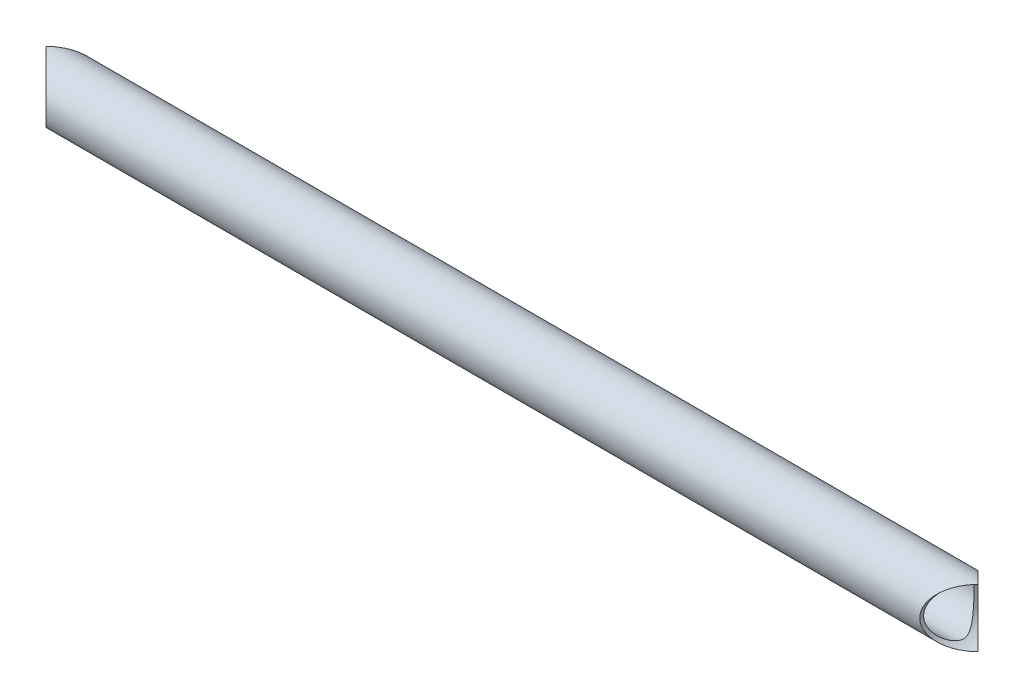
ISO-10303-21;
HEADER;
FILE_DESCRIPTION(('STEP AP214'),'2;1');
FILE_NAME('part.step','',(''),(''),'','','');
FILE_SCHEMA(('AUTOMOTIVE_DESIGN { 1 0 10303 214 1 1 1 1 }'));
ENDSEC;
DATA;
#1=APPLICATION_CONTEXT('core data for automotive mechanical design processes');
#2=APPLICATION_PROTOCOL_DEFINITION('international standard','automotive_design',2000,#1);
#3=PRODUCT_CONTEXT('',#1,'mechanical');
#4=PRODUCT('Part','Part','',(#3));
#5=PRODUCT_RELATED_PRODUCT_CATEGORY('part','',(#4));
#6=PRODUCT_DEFINITION_FORMATION('','',#4);
#7=PRODUCT_DEFINITION_CONTEXT('part definition',#1,'design');
#8=PRODUCT_DEFINITION('design','',#6,#7);
#9=PRODUCT_DEFINITION_SHAPE('','',#8);
#10=(LENGTH_UNIT() NAMED_UNIT(*) SI_UNIT(.MILLI.,.METRE.));
#11=(NAMED_UNIT(*) PLANE_ANGLE_UNIT() SI_UNIT($,.RADIAN.));
#12=(NAMED_UNIT(*) SI_UNIT($,.STERADIAN.) SOLID_ANGLE_UNIT());
#13=UNCERTAINTY_MEASURE_WITH_UNIT(LENGTH_MEASURE(1.E-05),#10,'distance_accuracy_value','');
#14=(GEOMETRIC_REPRESENTATION_CONTEXT(3) GLOBAL_UNCERTAINTY_ASSIGNED_CONTEXT((#13)) GLOBAL_UNIT_ASSIGNED_CONTEXT((#10,
#11,#12)) REPRESENTATION_CONTEXT('',''));
#15=CARTESIAN_POINT('',(0.,0.,0.));
#16=DIRECTION('',(0.,0.,1.));
#17=DIRECTION('',(1.,0.,0.));
#18=AXIS2_PLACEMENT_3D('',#15,#16,#17);
#19=CARTESIAN_POINT('',(152.4,228.6,-238.125));
#20=DIRECTION('',(0.,0.,1.));
#21=DIRECTION('',(1.,0.,0.));
#22=AXIS2_PLACEMENT_3D('',#19,#20,#21);
#23=CYLINDRICAL_SURFACE('',#22,9.52499999999999);
#24=CARTESIAN_POINT('',(152.4,228.6,101.6));
#25=DIRECTION('',(-0.707106781186547,0.,0.707106781186547));
#26=DIRECTION('',(-0.707106781186547,0.,-0.707106781186547));
#27=AXIS2_PLACEMENT_3D('',#24,#25,#26);
#28=ELLIPSE('',#27,13.4703841816037,9.525);
#29=CARTESIAN_POINT('',(152.4,219.075,101.6));
#30=VERTEX_POINT('',#29);
#31=CARTESIAN_POINT('',(152.4,238.125,101.6));
#32=VERTEX_POINT('',#31);
#33=EDGE_CURVE('E47',#30,#32,#28,.F.);
#34=ORIENTED_EDGE('',*,*,#33,.T.);
#35=CARTESIAN_POINT('',(152.4,228.6,101.6));
#36=DIRECTION('',(-0.707106781186547,0.,-0.707106781186547));
#37=DIRECTION('',(-0.707106781186547,0.,0.707106781186547));
#38=AXIS2_PLACEMENT_3D('',#35,#36,#37);
#39=ELLIPSE('',#38,13.4703841816037,9.525);
#40=EDGE_CURVE('E57',#32,#30,#39,.F.);
#41=ORIENTED_EDGE('',*,*,#40,.T.);
#42=EDGE_LOOP('',(#34,#41));
#43=FACE_BOUND('',#42,.T.);
#44=CARTESIAN_POINT('',(142.875,228.6,93.345));
#45=CARTESIAN_POINT('',(142.87500085137,228.793749133983,93.3450008690264));
#46=CARTESIAN_POINT('',(142.880923976125,228.987510695369,93.3518332191793));
#47=CARTESIAN_POINT('',(142.904480069302,229.373368577547,93.3790302122109));
#48=CARTESIAN_POINT('',(142.922114069863,229.565464750048,93.3993960478634));
#49=CARTESIAN_POINT('',(142.968700531082,229.946505754108,93.4532833019904));
#50=CARTESIAN_POINT('',(142.997658993398,230.135448859172,93.4868116962998));
#51=CARTESIAN_POINT('',(143.06626573945,230.508674190852,93.5664203169986));
#52=CARTESIAN_POINT('',(143.105914030754,230.692956414168,93.6125005522743));
#53=CARTESIAN_POINT('',(143.194816129542,231.054517254249,93.716123179868));
#54=CARTESIAN_POINT('',(143.244006461934,231.231833318214,93.7735898790905));
#55=CARTESIAN_POINT('',(143.351288626491,231.579870442184,93.8993730269408));
#56=CARTESIAN_POINT('',(143.409384351749,231.75058857676,93.9676942212121));
#57=CARTESIAN_POINT('',(143.533513866231,232.084651882336,94.1143137146301));
#58=CARTESIAN_POINT('',(143.599546793716,232.247997851083,94.1926109307414));
#59=CARTESIAN_POINT('',(143.738608516535,232.566887574014,94.3583747690309));
#60=CARTESIAN_POINT('',(143.811638843562,232.722429608553,94.4458433991799));
#61=CARTESIAN_POINT('',(143.992942230831,233.083524955091,94.6643639364956));
#62=CARTESIAN_POINT('',(144.103987372303,233.285372428281,94.7992626847607));
#63=CARTESIAN_POINT('',(144.335256151997,233.673118621409,95.0833820049045));
#64=CARTESIAN_POINT('',(144.455483046478,233.859011633082,95.2326076626131));
#65=CARTESIAN_POINT('',(144.703057246966,234.215142976407,95.5443145444013));
#66=CARTESIAN_POINT('',(144.83042068778,234.385343327033,95.7068262209706));
#67=CARTESIAN_POINT('',(145.089672364822,234.709650125725,96.0437532366055));
#68=CARTESIAN_POINT('',(145.221559996968,234.863758711384,96.2181669895244));
#69=CARTESIAN_POINT('',(145.490268739031,235.159109417956,96.5821129584457));
#70=CARTESIAN_POINT('',(145.627135289796,235.300013389537,96.7718857423579));
#71=CARTESIAN_POINT('',(145.900277029826,235.565304618899,97.1631704508306));
#72=CARTESIAN_POINT('',(146.036552013629,235.689686522828,97.3646861503101));
#73=CARTESIAN_POINT('',(146.304688635106,235.921483300549,97.7793667012964));
#74=CARTESIAN_POINT('',(146.436558723786,236.028932333052,97.9925069017138));
#75=CARTESIAN_POINT('',(146.691442369474,236.226529850752,98.4315681802966));
#76=CARTESIAN_POINT('',(146.81446287908,236.316692012068,98.6574789705415));
#77=CARTESIAN_POINT('',(147.050125579428,236.482003581481,99.1331855700168));
#78=CARTESIAN_POINT('',(147.162117857019,236.556366663297,99.3835853308334));
#79=CARTESIAN_POINT('',(147.358880568049,236.682480743163,99.9003610827135));
#80=CARTESIAN_POINT('',(147.443709065653,236.734280059203,100.166701532407));
#81=CARTESIAN_POINT('',(147.536097566616,236.789573262637,100.556059154657));
#82=CARTESIAN_POINT('',(147.560081572859,236.803739392844,100.673759859311));
#83=CARTESIAN_POINT('',(147.599826557136,236.827058784652,100.911009112553));
#84=CARTESIAN_POINT('',(147.615591423194,236.836214416546,101.030556759846));
#85=CARTESIAN_POINT('',(147.638195926769,236.849304199387,101.270679660663));
#86=CARTESIAN_POINT('',(147.645043337139,236.853242897697,101.391253926928));
#87=CARTESIAN_POINT('',(147.649515298126,236.855817780715,101.632633846071));
#88=CARTESIAN_POINT('',(147.647139751201,236.854453909342,101.753439501382));
#89=CARTESIAN_POINT('',(147.633287188579,236.846462088077,101.994165546023));
#90=CARTESIAN_POINT('',(147.621823920942,236.839842089721,102.114086996622));
#91=CARTESIAN_POINT('',(147.590347526087,236.821507905245,102.352426471255));
#92=CARTESIAN_POINT('',(147.570330763999,236.809791553356,102.47084383406));
#93=CARTESIAN_POINT('',(147.498589799333,236.767308180379,102.823106024142));
#94=CARTESIAN_POINT('',(147.435188530354,236.72921400914,103.053762928874));
#95=CARTESIAN_POINT('',(147.298694955178,236.644099327065,103.463707275849));
#96=CARTESIAN_POINT('',(147.229283916365,236.59983803945,103.644879966175));
#97=CARTESIAN_POINT('',(147.079042683176,236.500705639612,103.999533456991));
#98=CARTESIAN_POINT('',(146.998204624502,236.445827210796,104.173008851106));
#99=CARTESIAN_POINT('',(146.828240047895,236.32605718343,104.513020400759));
#100=CARTESIAN_POINT('',(146.739085754094,236.261131514579,104.679530400691));
#101=CARTESIAN_POINT('',(146.555384272125,236.121927466596,105.005438371793));
#102=CARTESIAN_POINT('',(146.460837695236,236.047650146436,105.164837145468));
#103=CARTESIAN_POINT('',(146.217533604388,235.848366005193,105.559509750453));
#104=CARTESIAN_POINT('',(146.066534072351,235.717295478695,105.790360618227));
#105=CARTESIAN_POINT('',(145.762225101465,235.434385836415,106.237475382706));
#106=CARTESIAN_POINT('',(145.608914543225,235.282536348192,106.453731913198));
#107=CARTESIAN_POINT('',(145.304431641632,234.958297438884,106.87132385376));
#108=CARTESIAN_POINT('',(145.153256847606,234.785934138232,107.072677720455));
#109=CARTESIAN_POINT('',(144.856523823392,234.42039386889,107.459938386393));
#110=CARTESIAN_POINT('',(144.710963114576,234.227226231587,107.64585204532));
#111=CARTESIAN_POINT('',(144.462698797748,233.86880872899,107.958208936394));
#112=CARTESIAN_POINT('',(144.358090176679,233.707976401375,108.088220417346));
#113=CARTESIAN_POINT('',(144.155601927927,233.374263989522,108.337565943495));
#114=CARTESIAN_POINT('',(144.057720826399,233.201386560908,108.456902329098));
#115=CARTESIAN_POINT('',(143.870359334607,232.843997602674,108.683660036511));
#116=CARTESIAN_POINT('',(143.780868875253,232.659500473618,108.791095668528));
#117=CARTESIAN_POINT('',(143.61178786899,232.279162252312,108.992909241783));
#118=CARTESIAN_POINT('',(143.532195476047,232.083323285382,109.087289618254));
#119=CARTESIAN_POINT('',(143.397688658435,231.716896785423,109.246074527202));
#120=CARTESIAN_POINT('',(143.340902606584,231.548010254906,109.312825158724));
#121=CARTESIAN_POINT('',(143.236041203049,231.203811346087,109.435723870585));
#122=CARTESIAN_POINT('',(143.187964032091,231.028500319075,109.491874165424));
#123=CARTESIAN_POINT('',(143.10137378059,230.672375751217,109.592779265616));
#124=CARTESIAN_POINT('',(143.062857419736,230.491564121593,109.637537979549));
#125=CARTESIAN_POINT('',(142.99611185728,230.125491254042,109.714979860089));
#126=CARTESIAN_POINT('',(142.967882768005,229.940229967554,109.747662894841));
#127=CARTESIAN_POINT('',(142.922193476377,229.565693777288,109.800511818281));
#128=CARTESIAN_POINT('',(142.904785183164,229.376403964306,109.820617373637));
#129=CARTESIAN_POINT('',(142.881337103709,228.99618049332,109.847689937369));
#130=CARTESIAN_POINT('',(142.875297343066,228.805246831617,109.854656916161));
#131=CARTESIAN_POINT('',(142.87472412799,228.42335468523,109.85531830954));
#132=CARTESIAN_POINT('',(142.880189796571,228.232396203547,109.849013735735));
#133=CARTESIAN_POINT('',(142.902501380858,227.852047815249,109.823254925655));
#134=CARTESIAN_POINT('',(142.91934681187,227.662657842174,109.803801249437));
#135=CARTESIAN_POINT('',(142.962336192805,227.301276987326,109.75408122776));
#136=CARTESIAN_POINT('',(142.987674409474,227.129059372116,109.724751037598));
#137=CARTESIAN_POINT('',(143.047291157423,226.788261428203,109.655611049683));
#138=CARTESIAN_POINT('',(143.08157267569,226.619682335142,109.615797750618));
#139=CARTESIAN_POINT('',(143.158481542436,226.287193793368,109.526259438729));
#140=CARTESIAN_POINT('',(143.201106417521,226.123282977198,109.47653736329));
#141=CARTESIAN_POINT('',(143.294060632431,225.800772493091,109.367775000269));
#142=CARTESIAN_POINT('',(143.344392844517,225.642174832152,109.308731238557));
#143=CARTESIAN_POINT('',(143.456253247045,225.318760887249,109.177025151324));
#144=CARTESIAN_POINT('',(143.518349023612,225.154427355193,109.103659113206));
#145=CARTESIAN_POINT('',(143.64974919785,224.833184711284,108.947655990891));
#146=CARTESIAN_POINT('',(143.719056432078,224.676278556494,108.86501525757));
#147=CARTESIAN_POINT('',(143.936469748638,224.217216319907,108.604285892716));
#148=CARTESIAN_POINT('',(144.094085643406,223.926665178198,108.413368849987));
#149=CARTESIAN_POINT('',(144.386795384044,223.445068693598,108.052832780472));
#150=CARTESIAN_POINT('',(144.518072006197,223.24698711938,107.88928934943));
#151=CARTESIAN_POINT('',(144.788096265142,222.869526138686,107.54739409173));
#152=CARTESIAN_POINT('',(144.926844378882,222.690147928305,107.369041319312));
#153=CARTESIAN_POINT('',(145.209205633139,222.349627109202,106.998278386676));
#154=CARTESIAN_POINT('',(145.352829852161,222.188530218004,106.805834881539));
#155=CARTESIAN_POINT('',(145.641483857342,221.884949827782,106.407884402478));
#156=CARTESIAN_POINT('',(145.786513199098,221.742460637592,106.202381451508));
#157=CARTESIAN_POINT('',(146.044840743108,221.503388496549,105.821700221537));
#158=CARTESIAN_POINT('',(146.158549640076,221.403382572897,105.648940344775));
#159=CARTESIAN_POINT('',(146.382312464771,221.215258160118,105.294706208171));
#160=CARTESIAN_POINT('',(146.492365718185,221.127141855052,105.11323035553));
#161=CARTESIAN_POINT('',(146.705590868976,220.963421066369,104.741468097759));
#162=CARTESIAN_POINT('',(146.80877963104,220.887785187886,104.5512053902));
#163=CARTESIAN_POINT('',(147.004599732918,220.749545792574,104.160911530404));
#164=CARTESIAN_POINT('',(147.097238506192,220.686933073675,103.96088739975));
#165=CARTESIAN_POINT('',(147.280539028389,220.566906121686,103.517101096186));
#166=CARTESIAN_POINT('',(147.368486554437,220.511947549068,103.271478439734));
#167=CARTESIAN_POINT('',(147.476624086336,220.445995162006,102.893660795415));
#168=CARTESIAN_POINT('',(147.508691291353,220.426766608547,102.76625357808));
#169=CARTESIAN_POINT('',(147.56361192475,220.394148700816,102.508760812182));
#170=CARTESIAN_POINT('',(147.586470306333,220.380756207151,102.378676743118));
#171=CARTESIAN_POINT('',(147.62206810894,220.360010368661,102.115053294316));
#172=CARTESIAN_POINT('',(147.634684394664,220.35273047777,101.981491235326));
#173=CARTESIAN_POINT('',(147.648619874186,220.344693892553,101.713582080059));
#174=CARTESIAN_POINT('',(147.649939911573,220.34393671112,101.579235043153));
#175=CARTESIAN_POINT('',(147.641202324924,220.348970145876,101.310965061402));
#176=CARTESIAN_POINT('',(147.631138307579,220.354764441386,101.17704239726));
#177=CARTESIAN_POINT('',(147.600209848149,220.372731137426,100.910888316258));
#178=CARTESIAN_POINT('',(147.579343623203,220.384904590814,100.778657182271));
#179=CARTESIAN_POINT('',(147.523697580562,220.417793404478,100.495453569936));
#180=CARTESIAN_POINT('',(147.487202723969,220.439578635414,100.344944712103));
#181=CARTESIAN_POINT('',(147.403191155665,220.490749992828,100.048296747313));
#182=CARTESIAN_POINT('',(147.355665479551,220.520142303591,99.9021613041312));
#183=CARTESIAN_POINT('',(147.251644772577,220.586021121705,99.6142908768544));
#184=CARTESIAN_POINT('',(147.19512334772,220.622528578341,99.4725703569083));
#185=CARTESIAN_POINT('',(147.075204077361,220.702066057463,99.1940418892089));
#186=CARTESIAN_POINT('',(147.011807777588,220.745094614622,99.057232846341));
#187=CARTESIAN_POINT('',(146.832749866028,220.870168950102,98.6924088143194));
#188=CARTESIAN_POINT('',(146.712045295214,220.958163433105,98.4688957415156));
#189=CARTESIAN_POINT('',(146.461768069578,221.150968983281,98.0344024139408));
#190=CARTESIAN_POINT('',(146.332189369989,221.255791579878,97.8234308885215));
#191=CARTESIAN_POINT('',(146.068538777804,221.481824189894,97.4129303438996));
#192=CARTESIAN_POINT('',(145.934460864055,221.603056880467,97.21341771302));
#193=CARTESIAN_POINT('',(145.665453567415,221.861578509005,96.825803988948));
#194=CARTESIAN_POINT('',(145.530524401609,221.998863498402,96.6377001066324));
#195=CARTESIAN_POINT('',(145.254370347392,222.298444095809,96.2617741255239));
#196=CARTESIAN_POINT('',(145.113264475866,222.461755311956,96.074671398808));
#197=CARTESIAN_POINT('',(144.836105671408,222.806719513531,95.7139830623498));
#198=CARTESIAN_POINT('',(144.70005372929,222.988376069838,95.5404000958897));
#199=CARTESIAN_POINT('',(144.436140711227,223.369682424321,95.2083989696898));
#200=CARTESIAN_POINT('',(144.30826219629,223.56929156607,95.0499481403575));
#201=CARTESIAN_POINT('',(144.063250623787,223.98667872514,94.7495745909276));
#202=CARTESIAN_POINT('',(143.946112658529,224.204448356632,94.6076443140066));
#203=CARTESIAN_POINT('',(143.757591966555,224.591711433497,94.3810439129687));
#204=CARTESIAN_POINT('',(143.682805017897,224.756843154747,94.2917199272702));
#205=CARTESIAN_POINT('',(143.54120930788,225.095556720758,94.1233934509296));
#206=CARTESIAN_POINT('',(143.474398582611,225.269136470562,94.0443884190954));
#207=CARTESIAN_POINT('',(143.349896757306,225.623998853516,93.8977100856031));
#208=CARTESIAN_POINT('',(143.292197695421,225.805274584102,93.8300268877313));
#209=CARTESIAN_POINT('',(143.186917126928,226.174795693031,93.7068816647786));
#210=CARTESIAN_POINT('',(143.139334511082,226.363040304596,93.6514182998052));
#211=CARTESIAN_POINT('',(143.061127906438,226.718653766488,93.560448258065));
#212=CARTESIAN_POINT('',(143.029064178173,226.885271665007,93.5232369778572));
#213=CARTESIAN_POINT('',(142.973668033218,227.221958753979,93.4590296318976));
#214=CARTESIAN_POINT('',(142.950338057636,227.392028895362,93.4320364221011));
#215=CARTESIAN_POINT('',(142.912838905102,227.734511854833,93.3886819470323));
#216=CARTESIAN_POINT('',(142.89866900201,227.906924486121,93.3723198390101));
#217=CARTESIAN_POINT('',(142.879750865947,228.252888376113,93.3504804377375));
#218=CARTESIAN_POINT('',(142.874999237341,228.426439201805,93.3449992215247));
#219=CARTESIAN_POINT('',(142.875,228.6,93.345));
#220=B_SPLINE_CURVE_WITH_KNOTS('',3,(#44,#45,#46,#47,#48,#49,#50,#51,#52,#53,#54,#55,#56,#57,
#58,#59,#60,#61,#62,#63,#64,#65,#66,#67,#68,#69,#70,#71,#72,#73,#74,#75,#76,#77,#78,#79,#80,#81,
#82,#83,#84,#85,#86,#87,#88,#89,#90,#91,#92,#93,#94,#95,#96,#97,#98,#99,#100,#101,#102,#103,
#104,#105,#106,#107,#108,#109,#110,#111,#112,#113,#114,#115,#116,#117,#118,#119,#120,#121,#122,
#123,#124,#125,#126,#127,#128,#129,#130,#131,#132,#133,#134,#135,#136,#137,#138,#139,#140,#141,
#142,#143,#144,#145,#146,#147,#148,#149,#150,#151,#152,#153,#154,#155,#156,#157,#158,#159,#160,
#161,#162,#163,#164,#165,#166,#167,#168,#169,#170,#171,#172,#173,#174,#175,#176,#177,#178,#179,
#180,#181,#182,#183,#184,#185,#186,#187,#188,#189,#190,#191,#192,#193,#194,#195,#196,#197,#198,
#199,#200,#201,#202,#203,#204,#205,#206,#207,#208,#209,#210,#211,#212,#213,#214,#215,#216,#217,
#218,#219),.UNSPECIFIED.,.T.,.F.,(4,2,2,2,2,2,2,2,2,2,2,2,2,2,2,2,2,2,2,2,2,2,2,2,2,2,2,2,2,2,2,
2,2,2,2,2,2,2,2,2,2,2,2,2,2,2,2,2,2,2,2,2,2,2,2,2,2,2,2,2,2,2,2,2,2,2,2,2,2,2,2,2,2,2,2,2,2,2,2,
2,2,2,2,2,2,2,2,4),(0.,0.581060302241175,1.16217182303355,1.74359173542285,2.32501205943971,
2.90268969124199,3.48062058537874,4.05848879048122,4.63648377810276,5.43621695420247,
6.23623508026257,7.03814127970882,7.83994081992864,8.65857780584574,9.47747942119562,
10.2947073130675,11.1112859813718,11.9620431912297,12.8109695269324,13.1734956172863,
13.5358500604876,13.8978884475343,14.2599306635729,14.6214262186982,14.9830755469357,
15.7069631447091,16.3031815010826,16.89981220255,17.4985123074859,18.0971446771323,
19.0121600805804,19.9276339189251,20.8419543021521,21.7558662790184,22.4505614625091,
23.1451039659047,23.8388020282264,24.5323705181271,25.1026275067059,25.6727652316906,
26.2427070714556,26.8126551342036,27.3853166471828,27.9579794496038,28.5305986031097,
29.1031933687764,29.6321866176356,30.1613567724987,30.6903702914557,31.2195814376324,
31.7901536941553,32.3609512342489,33.5023725912857,34.3667872613035,35.2312571774337,
36.0978433977629,36.9641639487797,37.6529096955541,38.341781789667,39.0288936791848,
39.715518398605,40.512573766315,40.9105237639805,41.3082594272077,41.7107088469782,
42.1131282121322,42.5157736890733,42.918485642225,43.38692566356,43.8557477127696,
44.32597156752,44.7960899166667,45.6013224389748,46.4071090223581,47.2140207141776,
48.0207343366109,48.8767355197428,49.7329036438819,50.5871794481831,51.441062941544,
52.0468024868874,52.6523925776822,53.2574505352096,53.862442115674,54.3830405578492,
54.9037844002805,55.4244869572119,55.9450017475653),.UNSPECIFIED.);
#221=CARTESIAN_POINT('',(142.875,228.6,93.345));
#222=VERTEX_POINT('',#221);
#223=EDGE_CURVE('E64',#222,#222,#220,.T.);
#224=ORIENTED_EDGE('',*,*,#223,.F.);
#225=EDGE_LOOP('',(#224));
#226=FACE_BOUND('',#225,.T.);
#227=ADVANCED_FACE('F33',(#43,#226),#23,.F.);
#228=CARTESIAN_POINT('',(-152.4,228.6,-238.125));
#229=DIRECTION('',(0.,0.,1.));
#230=DIRECTION('',(1.,0.,0.));
#231=AXIS2_PLACEMENT_3D('',#228,#229,#230);
#232=CYLINDRICAL_SURFACE('',#231,9.52499999999999);
#233=CARTESIAN_POINT('',(-152.4,228.6,101.6));
#234=DIRECTION('',(-0.707106781186547,0.,0.707106781186547));
#235=DIRECTION('',(-0.707106781186547,0.,-0.707106781186547));
#236=AXIS2_PLACEMENT_3D('',#233,#234,#235);
#237=ELLIPSE('',#236,13.4703841816037,9.525);
#238=CARTESIAN_POINT('',(-152.4,219.075,101.6));
#239=VERTEX_POINT('',#238);
#240=CARTESIAN_POINT('',(-152.4,238.125,101.6));
#241=VERTEX_POINT('',#240);
#242=EDGE_CURVE('E11',#239,#241,#237,.T.);
#243=ORIENTED_EDGE('',*,*,#242,.T.);
#244=CARTESIAN_POINT('',(-152.4,228.6,101.6));
#245=DIRECTION('',(-0.707106781186547,0.,-0.707106781186547));
#246=DIRECTION('',(-0.707106781186547,0.,0.707106781186547));
#247=AXIS2_PLACEMENT_3D('',#244,#245,#246);
#248=ELLIPSE('',#247,13.4703841816037,9.525);
#249=EDGE_CURVE('E41',#241,#239,#248,.T.);
#250=ORIENTED_EDGE('',*,*,#249,.T.);
#251=EDGE_LOOP('',(#243,#250));
#252=FACE_BOUND('',#251,.T.);
#253=CARTESIAN_POINT('',(-142.875,228.6,109.855));
#254=CARTESIAN_POINT('',(-142.87500085137,228.793749133983,109.854999130974));
#255=CARTESIAN_POINT('',(-142.880923976125,228.987510695369,109.848166780821));
#256=CARTESIAN_POINT('',(-142.904480069302,229.373368577547,109.820969787789));
#257=CARTESIAN_POINT('',(-142.922114069863,229.565464750048,109.800603952137));
#258=CARTESIAN_POINT('',(-142.968700531082,229.946505754108,109.74671669801));
#259=CARTESIAN_POINT('',(-142.997658993398,230.135448859172,109.7131883037));
#260=CARTESIAN_POINT('',(-143.06626573945,230.508674190852,109.633579683001));
#261=CARTESIAN_POINT('',(-143.105914030754,230.692956414168,109.587499447726));
#262=CARTESIAN_POINT('',(-143.194816129542,231.054517254249,109.483876820132));
#263=CARTESIAN_POINT('',(-143.244006461934,231.231833318214,109.42641012091));
#264=CARTESIAN_POINT('',(-143.351288626491,231.579870442184,109.300626973059));
#265=CARTESIAN_POINT('',(-143.409384351749,231.75058857676,109.232305778788));
#266=CARTESIAN_POINT('',(-143.533513866231,232.084651882336,109.08568628537));
#267=CARTESIAN_POINT('',(-143.599546793716,232.247997851083,109.007389069259));
#268=CARTESIAN_POINT('',(-143.738608516535,232.566887574014,108.841625230969));
#269=CARTESIAN_POINT('',(-143.811638843562,232.722429608553,108.75415660082));
#270=CARTESIAN_POINT('',(-143.992942230831,233.083524955091,108.535636063504));
#271=CARTESIAN_POINT('',(-144.103987372303,233.285372428281,108.400737315239));
#272=CARTESIAN_POINT('',(-144.335256151997,233.673118621409,108.116617995095));
#273=CARTESIAN_POINT('',(-144.455483046478,233.859011633082,107.967392337387));
#274=CARTESIAN_POINT('',(-144.703057246966,234.215142976407,107.655685455599));
#275=CARTESIAN_POINT('',(-144.83042068778,234.385343327033,107.493173779029));
#276=CARTESIAN_POINT('',(-145.089672364822,234.709650125725,107.156246763394));
#277=CARTESIAN_POINT('',(-145.221559996968,234.863758711384,106.981833010476));
#278=CARTESIAN_POINT('',(-145.490268739031,235.159109417956,106.617887041554));
#279=CARTESIAN_POINT('',(-145.627135289795,235.300013389537,106.428114257642));
#280=CARTESIAN_POINT('',(-145.900277029826,235.565304618899,106.036829549169));
#281=CARTESIAN_POINT('',(-146.036552013629,235.689686522828,105.83531384969));
#282=CARTESIAN_POINT('',(-146.304688635106,235.921483300549,105.420633298704));
#283=CARTESIAN_POINT('',(-146.436558723786,236.028932333052,105.207493098286));
#284=CARTESIAN_POINT('',(-146.691442369474,236.226529850752,104.768431819703));
#285=CARTESIAN_POINT('',(-146.81446287908,236.316692012068,104.542521029458));
#286=CARTESIAN_POINT('',(-147.050125579428,236.482003581481,104.066814429983));
#287=CARTESIAN_POINT('',(-147.162117857019,236.556366663297,103.816414669167));
#288=CARTESIAN_POINT('',(-147.358880568049,236.682480743163,103.299638917286));
#289=CARTESIAN_POINT('',(-147.443709065653,236.734280059203,103.033298467592));
#290=CARTESIAN_POINT('',(-147.536097566616,236.789573262637,102.643940845343));
#291=CARTESIAN_POINT('',(-147.560081572859,236.803739392844,102.526240140689));
#292=CARTESIAN_POINT('',(-147.599826557136,236.827058784652,102.288990887447));
#293=CARTESIAN_POINT('',(-147.615591423194,236.836214416546,102.169443240154));
#294=CARTESIAN_POINT('',(-147.638195926769,236.849304199387,101.929320339337));
#295=CARTESIAN_POINT('',(-147.645043337139,236.853242897697,101.808746073072));
#296=CARTESIAN_POINT('',(-147.649515298126,236.855817780715,101.567366153929));
#297=CARTESIAN_POINT('',(-147.647139751201,236.854453909342,101.446560498618));
#298=CARTESIAN_POINT('',(-147.633287188579,236.846462088077,101.205834453977));
#299=CARTESIAN_POINT('',(-147.621823920942,236.839842089721,101.085913003378));
#300=CARTESIAN_POINT('',(-147.590347526087,236.821507905245,100.847573528745));
#301=CARTESIAN_POINT('',(-147.570330763999,236.809791553356,100.72915616594));
#302=CARTESIAN_POINT('',(-147.498589799333,236.767308180379,100.376893975858));
#303=CARTESIAN_POINT('',(-147.435188530354,236.72921400914,100.146237071126));
#304=CARTESIAN_POINT('',(-147.298694955178,236.644099327065,99.7362927241506));
#305=CARTESIAN_POINT('',(-147.229283916365,236.59983803945,99.5551200338247));
#306=CARTESIAN_POINT('',(-147.079042683176,236.500705639612,99.2004665430093));
#307=CARTESIAN_POINT('',(-146.998204624502,236.445827210796,99.0269911488941));
#308=CARTESIAN_POINT('',(-146.828240047895,236.32605718343,98.6869795992413));
#309=CARTESIAN_POINT('',(-146.739085754094,236.261131514579,98.5204695993091));
#310=CARTESIAN_POINT('',(-146.555384272125,236.121927466596,98.1945616282065));
#311=CARTESIAN_POINT('',(-146.460837695236,236.047650146436,98.035162854532));
#312=CARTESIAN_POINT('',(-146.217533604388,235.848366005193,97.6404902495467));
#313=CARTESIAN_POINT('',(-146.066534072351,235.717295478695,97.4096393817731));
#314=CARTESIAN_POINT('',(-145.762225101465,235.434385836415,96.962524617294));
#315=CARTESIAN_POINT('',(-145.608914543225,235.282536348192,96.746268086802));
#316=CARTESIAN_POINT('',(-145.304431641632,234.958297438884,96.3286761462399));
#317=CARTESIAN_POINT('',(-145.153256847605,234.785934138232,96.127322279545));
#318=CARTESIAN_POINT('',(-144.856523823392,234.42039386889,95.7400616136068));
#319=CARTESIAN_POINT('',(-144.710963114576,234.227226231587,95.5541479546798));
#320=CARTESIAN_POINT('',(-144.462698797748,233.86880872899,95.2417910636064));
#321=CARTESIAN_POINT('',(-144.358090176679,233.707976401375,95.1117795826543));
#322=CARTESIAN_POINT('',(-144.155601927927,233.374263989522,94.8624340565053));
#323=CARTESIAN_POINT('',(-144.057720826399,233.201386560908,94.7430976709017));
#324=CARTESIAN_POINT('',(-143.870359334607,232.843997602674,94.5163399634888));
#325=CARTESIAN_POINT('',(-143.780868875253,232.659500473618,94.4089043314715));
#326=CARTESIAN_POINT('',(-143.611787868989,232.279162252312,94.2070907582165));
#327=CARTESIAN_POINT('',(-143.532195476047,232.083323285382,94.1127103817458));
#328=CARTESIAN_POINT('',(-143.397688658435,231.716896785423,93.9539254727978));
#329=CARTESIAN_POINT('',(-143.340902606584,231.548010254906,93.8871748412764));
#330=CARTESIAN_POINT('',(-143.236041203049,231.203811346087,93.7642761294147));
#331=CARTESIAN_POINT('',(-143.187964032091,231.028500319075,93.7081258345755));
#332=CARTESIAN_POINT('',(-143.10137378059,230.672375751217,93.6072207343836));
#333=CARTESIAN_POINT('',(-143.062857419736,230.491564121593,93.5624620204508));
#334=CARTESIAN_POINT('',(-142.99611185728,230.125491254042,93.4850201399113));
#335=CARTESIAN_POINT('',(-142.967882768004,229.940229967554,93.4523371051585));
#336=CARTESIAN_POINT('',(-142.922193476377,229.565693777288,93.3994881817187));
#337=CARTESIAN_POINT('',(-142.904785183164,229.376403964306,93.3793826263627));
#338=CARTESIAN_POINT('',(-142.881337103709,228.99618049332,93.352310062631));
#339=CARTESIAN_POINT('',(-142.875297343065,228.805246831617,93.345343083839));
#340=CARTESIAN_POINT('',(-142.87472412799,228.42335468523,93.3446816904598));
#341=CARTESIAN_POINT('',(-142.880189796571,228.232396203547,93.3509862642653));
#342=CARTESIAN_POINT('',(-142.902501380858,227.852047815249,93.3767450743445));
#343=CARTESIAN_POINT('',(-142.91934681187,227.662657842174,93.396198750563));
#344=CARTESIAN_POINT('',(-142.962336192805,227.301276987326,93.4459187722398));
#345=CARTESIAN_POINT('',(-142.987674409474,227.129059372116,93.4752489624016));
#346=CARTESIAN_POINT('',(-143.047291157423,226.788261428203,93.544388950317));
#347=CARTESIAN_POINT('',(-143.08157267569,226.619682335142,93.5842022493825));
#348=CARTESIAN_POINT('',(-143.158481542436,226.287193793368,93.673740561271));
#349=CARTESIAN_POINT('',(-143.201106417521,226.123282977198,93.7234626367097));
#350=CARTESIAN_POINT('',(-143.294060632431,225.800772493091,93.8322249997312));
#351=CARTESIAN_POINT('',(-143.344392844517,225.642174832152,93.8912687614435));
#352=CARTESIAN_POINT('',(-143.456253247045,225.318760887249,94.022974848676));
#353=CARTESIAN_POINT('',(-143.518349023612,225.154427355193,94.096340886794));
#354=CARTESIAN_POINT('',(-143.64974919785,224.833184711284,94.2523440091093));
#355=CARTESIAN_POINT('',(-143.719056432078,224.676278556494,94.3349847424298));
#356=CARTESIAN_POINT('',(-143.936469748638,224.217216319907,94.5957141072836));
#357=CARTESIAN_POINT('',(-144.094085643406,223.926665178198,94.7866311500132));
#358=CARTESIAN_POINT('',(-144.386795384043,223.445068693598,95.1471672195281));
#359=CARTESIAN_POINT('',(-144.518072006197,223.24698711938,95.3107106505702));
#360=CARTESIAN_POINT('',(-144.788096265142,222.869526138686,95.6526059082699));
#361=CARTESIAN_POINT('',(-144.926844378882,222.690147928305,95.8309586806876));
#362=CARTESIAN_POINT('',(-145.209205633139,222.349627109202,96.201721613324));
#363=CARTESIAN_POINT('',(-145.352829852161,222.188530218004,96.3941651184609));
#364=CARTESIAN_POINT('',(-145.641483857342,221.884949827782,96.7921155975218));
#365=CARTESIAN_POINT('',(-145.786513199098,221.742460637592,96.9976185484917));
#366=CARTESIAN_POINT('',(-146.044840743108,221.503388496549,97.3782997784627));
#367=CARTESIAN_POINT('',(-146.158549640075,221.403382572897,97.5510596552251));
#368=CARTESIAN_POINT('',(-146.382312464771,221.215258160118,97.9052937918285));
#369=CARTESIAN_POINT('',(-146.492365718185,221.127141855052,98.0867696444704));
#370=CARTESIAN_POINT('',(-146.705590868976,220.963421066369,98.4585319022405));
#371=CARTESIAN_POINT('',(-146.80877963104,220.887785187886,98.6487946098));
#372=CARTESIAN_POINT('',(-147.004599732918,220.749545792574,99.039088469596));
#373=CARTESIAN_POINT('',(-147.097238506192,220.686933073675,99.2391126002503));
#374=CARTESIAN_POINT('',(-147.280539028389,220.566906121686,99.6828989038143));
#375=CARTESIAN_POINT('',(-147.368486554437,220.511947549068,99.9285215602658));
#376=CARTESIAN_POINT('',(-147.476624086336,220.445995162006,100.306339204585));
#377=CARTESIAN_POINT('',(-147.508691291353,220.426766608547,100.43374642192));
#378=CARTESIAN_POINT('',(-147.56361192475,220.394148700816,100.691239187818));
#379=CARTESIAN_POINT('',(-147.586470306333,220.380756207151,100.821323256882));
#380=CARTESIAN_POINT('',(-147.62206810894,220.360010368661,101.084946705684));
#381=CARTESIAN_POINT('',(-147.634684394664,220.35273047777,101.218508764674));
#382=CARTESIAN_POINT('',(-147.648619874186,220.344693892553,101.486417919941));
#383=CARTESIAN_POINT('',(-147.649939911573,220.34393671112,101.620764956847));
#384=CARTESIAN_POINT('',(-147.641202324923,220.348970145876,101.889034938598));
#385=CARTESIAN_POINT('',(-147.631138307579,220.354764441386,102.02295760274));
#386=CARTESIAN_POINT('',(-147.600209848149,220.372731137426,102.289111683742));
#387=CARTESIAN_POINT('',(-147.579343623203,220.384904590814,102.421342817729));
#388=CARTESIAN_POINT('',(-147.523697580561,220.417793404478,102.704546430064));
#389=CARTESIAN_POINT('',(-147.487202723969,220.439578635414,102.855055287897));
#390=CARTESIAN_POINT('',(-147.403191155665,220.490749992828,103.151703252687));
#391=CARTESIAN_POINT('',(-147.355665479551,220.520142303591,103.297838695869));
#392=CARTESIAN_POINT('',(-147.251644772577,220.586021121705,103.585709123146));
#393=CARTESIAN_POINT('',(-147.19512334772,220.622528578341,103.727429643092));
#394=CARTESIAN_POINT('',(-147.07520407736,220.702066057463,104.005958110791));
#395=CARTESIAN_POINT('',(-147.011807777588,220.745094614622,104.142767153659));
#396=CARTESIAN_POINT('',(-146.832749866028,220.870168950102,104.507591185681));
#397=CARTESIAN_POINT('',(-146.712045295214,220.958163433105,104.731104258484));
#398=CARTESIAN_POINT('',(-146.461768069578,221.150968983281,105.165597586059));
#399=CARTESIAN_POINT('',(-146.332189369989,221.255791579878,105.376569111478));
#400=CARTESIAN_POINT('',(-146.068538777804,221.481824189894,105.7870696561));
#401=CARTESIAN_POINT('',(-145.934460864055,221.603056880467,105.98658228698));
#402=CARTESIAN_POINT('',(-145.665453567414,221.861578509005,106.374196011052));
#403=CARTESIAN_POINT('',(-145.530524401609,221.998863498402,106.562299893368));
#404=CARTESIAN_POINT('',(-145.254370347392,222.298444095809,106.938225874476));
#405=CARTESIAN_POINT('',(-145.113264475866,222.461755311956,107.125328601192));
#406=CARTESIAN_POINT('',(-144.836105671408,222.806719513531,107.48601693765));
#407=CARTESIAN_POINT('',(-144.70005372929,222.988376069838,107.65959990411));
#408=CARTESIAN_POINT('',(-144.436140711227,223.369682424321,107.99160103031));
#409=CARTESIAN_POINT('',(-144.30826219629,223.56929156607,108.150051859642));
#410=CARTESIAN_POINT('',(-144.063250623786,223.98667872514,108.450425409072));
#411=CARTESIAN_POINT('',(-143.946112658529,224.204448356632,108.592355685993));
#412=CARTESIAN_POINT('',(-143.757591966555,224.591711433497,108.818956087031));
#413=CARTESIAN_POINT('',(-143.682805017896,224.756843154747,108.90828007273));
#414=CARTESIAN_POINT('',(-143.54120930788,225.095556720758,109.07660654907));
#415=CARTESIAN_POINT('',(-143.474398582611,225.269136470562,109.155611580905));
#416=CARTESIAN_POINT('',(-143.349896757306,225.623998853516,109.302289914397));
#417=CARTESIAN_POINT('',(-143.292197695421,225.805274584102,109.369973112269));
#418=CARTESIAN_POINT('',(-143.186917126928,226.174795693031,109.493118335221));
#419=CARTESIAN_POINT('',(-143.139334511082,226.363040304596,109.548581700195));
#420=CARTESIAN_POINT('',(-143.061127906438,226.718653766488,109.639551741935));
#421=CARTESIAN_POINT('',(-143.029064178173,226.885271665007,109.676763022143));
#422=CARTESIAN_POINT('',(-142.973668033218,227.221958753979,109.740970368102));
#423=CARTESIAN_POINT('',(-142.950338057636,227.392028895362,109.767963577899));
#424=CARTESIAN_POINT('',(-142.912838905101,227.734511854833,109.811318052968));
#425=CARTESIAN_POINT('',(-142.89866900201,227.906924486121,109.82768016099));
#426=CARTESIAN_POINT('',(-142.879750865947,228.252888376113,109.849519562262));
#427=CARTESIAN_POINT('',(-142.874999237341,228.426439201805,109.855000778475));
#428=CARTESIAN_POINT('',(-142.875,228.6,109.855));
#429=B_SPLINE_CURVE_WITH_KNOTS('',3,(#253,#254,#255,#256,#257,#258,#259,#260,#261,#262,#263,
#264,#265,#266,#267,#268,#269,#270,#271,#272,#273,#274,#275,#276,#277,#278,#279,#280,#281,#282,
#283,#284,#285,#286,#287,#288,#289,#290,#291,#292,#293,#294,#295,#296,#297,#298,#299,#300,#301,
#302,#303,#304,#305,#306,#307,#308,#309,#310,#311,#312,#313,#314,#315,#316,#317,#318,#319,#320,
#321,#322,#323,#324,#325,#326,#327,#328,#329,#330,#331,#332,#333,#334,#335,#336,#337,#338,#339,
#340,#341,#342,#343,#344,#345,#346,#347,#348,#349,#350,#351,#352,#353,#354,#355,#356,#357,#358,
#359,#360,#361,#362,#363,#364,#365,#366,#367,#368,#369,#370,#371,#372,#373,#374,#375,#376,#377,
#378,#379,#380,#381,#382,#383,#384,#385,#386,#387,#388,#389,#390,#391,#392,#393,#394,#395,#396,
#397,#398,#399,#400,#401,#402,#403,#404,#405,#406,#407,#408,#409,#410,#411,#412,#413,#414,#415,
#416,#417,#418,#419,#420,#421,#422,#423,#424,#425,#426,#427,#428),.UNSPECIFIED.,.T.,.F.,(4,2,2,
2,2,2,2,2,2,2,2,2,2,2,2,2,2,2,2,2,2,2,2,2,2,2,2,2,2,2,2,2,2,2,2,2,2,2,2,2,2,2,2,2,2,2,2,2,2,2,2,
2,2,2,2,2,2,2,2,2,2,2,2,2,2,2,2,2,2,2,2,2,2,2,2,2,2,2,2,2,2,2,2,2,2,2,2,4),(0.,
0.581060302241175,1.16217182303355,1.74359173542285,2.32501205943971,2.90268969124202,
3.48062058537874,4.05848879048122,4.63648377810276,5.43621695420248,6.23623508026257,
7.03814127970883,7.83994081992864,8.65857780584573,9.47747942119566,10.2947073130675,
11.1112859813718,11.9620431912297,12.8109695269324,13.1734956172863,13.5358500604876,
13.8978884475343,14.2599306635729,14.6214262186982,14.9830755469357,15.7069631447091,
16.3031815010825,16.8998122025499,17.4985123074859,18.0971446771323,19.0121600805804,
19.9276339189251,20.8419543021521,21.7558662790184,22.450561462509,23.1451039659047,
23.8388020282264,24.5323705181271,25.1026275067059,25.6727652316906,26.2427070714556,
26.8126551342036,27.3853166471828,27.9579794496038,28.5305986031097,29.1031933687764,
29.6321866176356,30.1613567724987,30.6903702914557,31.2195814376323,31.7901536941553,
32.3609512342489,33.5023725912857,34.3667872613035,35.2312571774337,36.0978433977629,
36.9641639487797,37.6529096955541,38.341781789667,39.0288936791848,39.715518398605,
40.512573766315,40.9105237639805,41.3082594272077,41.7107088469781,42.1131282121322,
42.5157736890734,42.918485642225,43.38692566356,43.8557477127696,44.32597156752,
44.7960899166667,45.6013224389748,46.4071090223581,47.2140207141776,48.0207343366109,
48.8767355197428,49.7329036438819,50.587179448183,51.441062941544,52.0468024868874,
52.6523925776822,53.2574505352096,53.862442115674,54.3830405578492,54.9037844002805,
55.4244869572119,55.9450017475653),.UNSPECIFIED.);
#430=CARTESIAN_POINT('',(-142.875,228.6,109.855));
#431=VERTEX_POINT('',#430);
#432=EDGE_CURVE('E60',#431,#431,#429,.T.);
#433=ORIENTED_EDGE('',*,*,#432,.F.);
#434=EDGE_LOOP('',(#433));
#435=FACE_BOUND('',#434,.T.);
#436=ADVANCED_FACE('F83',(#252,#435),#232,.F.);
#437=CARTESIAN_POINT('',(152.4,228.6,101.6));
#438=DIRECTION('',(-1.,0.,0.));
#439=DIRECTION('',(0.,0.,1.));
#440=AXIS2_PLACEMENT_3D('',#437,#438,#439);
#441=CYLINDRICAL_SURFACE('',#440,9.52500000000001);
#442=ORIENTED_EDGE('',*,*,#242,.F.);
#443=ORIENTED_EDGE('',*,*,#249,.F.);
#444=EDGE_LOOP('',(#442,#443));
#445=FACE_BOUND('',#444,.T.);
#446=ORIENTED_EDGE('',*,*,#33,.F.);
#447=ORIENTED_EDGE('',*,*,#40,.F.);
#448=EDGE_LOOP('',(#446,#447));
#449=FACE_BOUND('',#448,.T.);
#450=ADVANCED_FACE('F35',(#445,#449),#441,.T.);
#451=CARTESIAN_POINT('',(152.4,228.6,101.6));
#452=DIRECTION('',(-1.,0.,0.));
#453=DIRECTION('',(0.,0.,1.));
#454=AXIS2_PLACEMENT_3D('',#451,#452,#453);
#455=CYLINDRICAL_SURFACE('',#454,8.25500000000001);
#456=ORIENTED_EDGE('',*,*,#432,.T.);
#457=EDGE_LOOP('',(#456));
#458=FACE_BOUND('',#457,.T.);
#459=ORIENTED_EDGE('',*,*,#223,.T.);
#460=EDGE_LOOP('',(#459));
#461=FACE_BOUND('',#460,.T.);
#462=ADVANCED_FACE('F76',(#458,#461),#455,.F.);
#463=CLOSED_SHELL('',(#227,#436,#450,#462));
#464=MANIFOLD_SOLID_BREP('B2',#463);
#465=ADVANCED_BREP_SHAPE_REPRESENTATION('',(#18,#464),#14);
#466=SHAPE_DEFINITION_REPRESENTATION(#9,#465);
ENDSEC;
END-ISO-10303-21;
